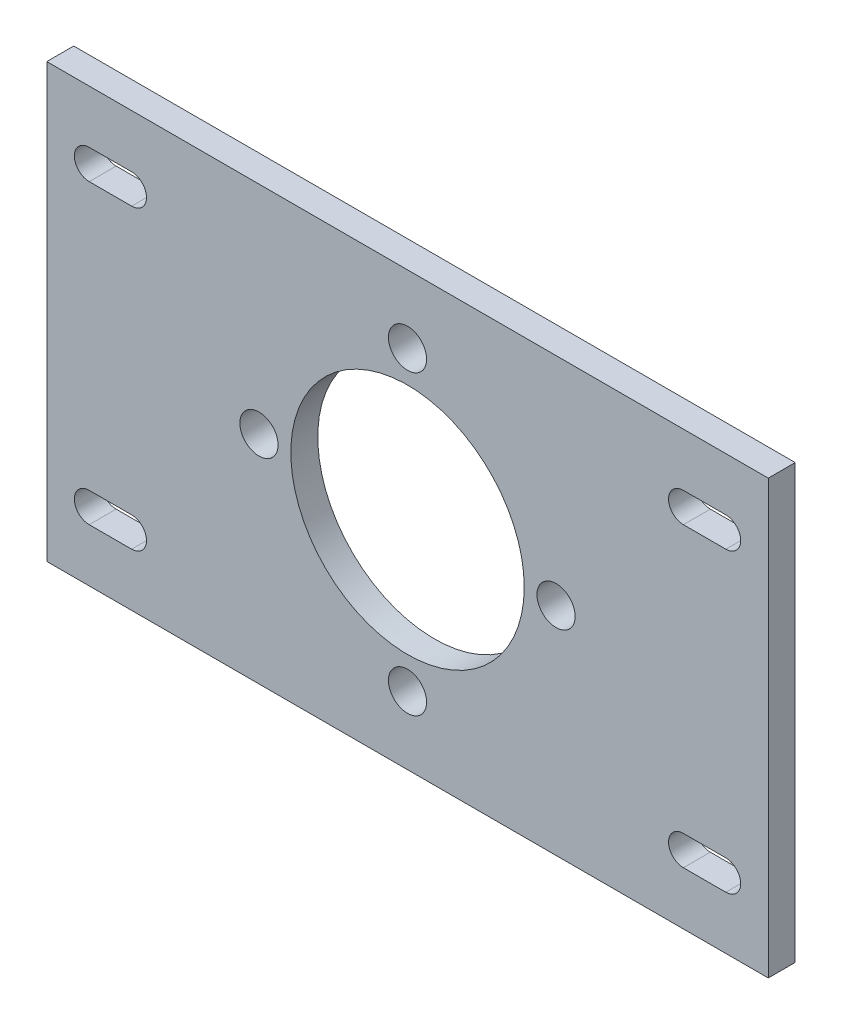
ISO-10303-21;
HEADER;
FILE_DESCRIPTION(('STEP AP214'),'2;1');
FILE_NAME('part.step','',(''),(''),'','','');
FILE_SCHEMA(('AUTOMOTIVE_DESIGN { 1 0 10303 214 1 1 1 1 }'));
ENDSEC;
DATA;
#1=APPLICATION_CONTEXT('core data for automotive mechanical design processes');
#2=APPLICATION_PROTOCOL_DEFINITION('international standard','automotive_design',2000,#1);
#3=PRODUCT_CONTEXT('',#1,'mechanical');
#4=PRODUCT('Part','Part','',(#3));
#5=PRODUCT_RELATED_PRODUCT_CATEGORY('part','',(#4));
#6=PRODUCT_DEFINITION_FORMATION('','',#4);
#7=PRODUCT_DEFINITION_CONTEXT('part definition',#1,'design');
#8=PRODUCT_DEFINITION('design','',#6,#7);
#9=PRODUCT_DEFINITION_SHAPE('','',#8);
#10=(LENGTH_UNIT() NAMED_UNIT(*) SI_UNIT(.MILLI.,.METRE.));
#11=(NAMED_UNIT(*) PLANE_ANGLE_UNIT() SI_UNIT($,.RADIAN.));
#12=(NAMED_UNIT(*) SI_UNIT($,.STERADIAN.) SOLID_ANGLE_UNIT());
#13=UNCERTAINTY_MEASURE_WITH_UNIT(LENGTH_MEASURE(1.E-05),#10,'distance_accuracy_value','');
#14=(GEOMETRIC_REPRESENTATION_CONTEXT(3) GLOBAL_UNCERTAINTY_ASSIGNED_CONTEXT((#13)) GLOBAL_UNIT_ASSIGNED_CONTEXT((#10,
#11,#12)) REPRESENTATION_CONTEXT('',''));
#15=CARTESIAN_POINT('',(0.,0.,0.));
#16=DIRECTION('',(0.,0.,1.));
#17=DIRECTION('',(1.,0.,0.));
#18=AXIS2_PLACEMENT_3D('',#15,#16,#17);
#19=CARTESIAN_POINT('',(0.,0.,3.175));
#20=DIRECTION('',(0.,0.,-1.));
#21=DIRECTION('',(-1.,0.,0.));
#22=AXIS2_PLACEMENT_3D('',#19,#20,#21);
#23=PLANE('',#22);
#24=CARTESIAN_POINT('',(37.5,-17.5,3.175));
#25=DIRECTION('',(0.,0.,1.));
#26=DIRECTION('',(1.,0.,0.));
#27=AXIS2_PLACEMENT_3D('',#24,#25,#26);
#28=CIRCLE('',#27,1.75000000000003);
#29=CARTESIAN_POINT('',(37.5,-19.2500000000001,3.175));
#30=VERTEX_POINT('',#29);
#31=CARTESIAN_POINT('',(37.5,-15.75,3.175));
#32=VERTEX_POINT('',#31);
#33=EDGE_CURVE('E454',#30,#32,#28,.T.);
#34=ORIENTED_EDGE('',*,*,#33,.F.);
#35=DIRECTION('',(1.,0.,0.));
#36=VECTOR('',#35,1.);
#37=CARTESIAN_POINT('',(37.5,-19.2500000000001,3.175));
#38=LINE('',#37,#36);
#39=CARTESIAN_POINT('',(32.5,-19.2500000000001,3.175));
#40=VERTEX_POINT('',#39);
#41=EDGE_CURVE('E444',#40,#30,#38,.T.);
#42=ORIENTED_EDGE('',*,*,#41,.F.);
#43=CARTESIAN_POINT('',(32.5,-17.5,3.175));
#44=DIRECTION('',(0.,0.,1.));
#45=DIRECTION('',(1.,0.,0.));
#46=AXIS2_PLACEMENT_3D('',#43,#44,#45);
#47=CIRCLE('',#46,1.75000000000003);
#48=CARTESIAN_POINT('',(32.5,-15.75,3.175));
#49=VERTEX_POINT('',#48);
#50=EDGE_CURVE('E447',#49,#40,#47,.T.);
#51=ORIENTED_EDGE('',*,*,#50,.F.);
#52=DIRECTION('',(-1.,0.,0.));
#53=VECTOR('',#52,1.);
#54=CARTESIAN_POINT('',(37.5,-15.75,3.175));
#55=LINE('',#54,#53);
#56=EDGE_CURVE('E451',#32,#49,#55,.T.);
#57=ORIENTED_EDGE('',*,*,#56,.F.);
#58=EDGE_LOOP('',(#34,#42,#51,#57));
#59=FACE_BOUND('',#58,.T.);
#60=CARTESIAN_POINT('',(-37.5,17.5,3.175));
#61=DIRECTION('',(0.,0.,1.));
#62=DIRECTION('',(1.,0.,0.));
#63=AXIS2_PLACEMENT_3D('',#60,#61,#62);
#64=CIRCLE('',#63,1.75000000000003);
#65=CARTESIAN_POINT('',(-37.5,19.2500000000001,3.175));
#66=VERTEX_POINT('',#65);
#67=CARTESIAN_POINT('',(-37.5,15.75,3.175));
#68=VERTEX_POINT('',#67);
#69=EDGE_CURVE('E386',#66,#68,#64,.T.);
#70=ORIENTED_EDGE('',*,*,#69,.F.);
#71=DIRECTION('',(-1.,0.,0.));
#72=VECTOR('',#71,1.);
#73=CARTESIAN_POINT('',(-37.5,19.2500000000001,3.175));
#74=LINE('',#73,#72);
#75=CARTESIAN_POINT('',(-32.5,19.2500000000001,3.175));
#76=VERTEX_POINT('',#75);
#77=EDGE_CURVE('E376',#76,#66,#74,.T.);
#78=ORIENTED_EDGE('',*,*,#77,.F.);
#79=CARTESIAN_POINT('',(-32.5,17.5,3.175));
#80=DIRECTION('',(0.,0.,1.));
#81=DIRECTION('',(1.,0.,0.));
#82=AXIS2_PLACEMENT_3D('',#79,#80,#81);
#83=CIRCLE('',#82,1.75000000000003);
#84=CARTESIAN_POINT('',(-32.5,15.75,3.175));
#85=VERTEX_POINT('',#84);
#86=EDGE_CURVE('E379',#85,#76,#83,.T.);
#87=ORIENTED_EDGE('',*,*,#86,.F.);
#88=DIRECTION('',(1.,0.,0.));
#89=VECTOR('',#88,1.);
#90=CARTESIAN_POINT('',(-37.5,15.75,3.175));
#91=LINE('',#90,#89);
#92=EDGE_CURVE('E383',#68,#85,#91,.T.);
#93=ORIENTED_EDGE('',*,*,#92,.F.);
#94=EDGE_LOOP('',(#70,#78,#87,#93));
#95=FACE_BOUND('',#94,.T.);
#96=DIRECTION('',(0.,-1.,0.));
#97=VECTOR('',#96,1.);
#98=CARTESIAN_POINT('',(-42.5,-25.5,3.175));
#99=LINE('',#98,#97);
#100=CARTESIAN_POINT('',(-42.5,25.5,3.175));
#101=VERTEX_POINT('',#100);
#102=CARTESIAN_POINT('',(-42.5,-25.5,3.175));
#103=VERTEX_POINT('',#102);
#104=EDGE_CURVE('E298',#101,#103,#99,.T.);
#105=ORIENTED_EDGE('',*,*,#104,.T.);
#106=DIRECTION('',(1.,0.,0.));
#107=VECTOR('',#106,1.);
#108=CARTESIAN_POINT('',(-42.5,-25.5,3.175));
#109=LINE('',#108,#107);
#110=CARTESIAN_POINT('',(42.5,-25.5,3.175));
#111=VERTEX_POINT('',#110);
#112=EDGE_CURVE('E303',#103,#111,#109,.T.);
#113=ORIENTED_EDGE('',*,*,#112,.T.);
#114=DIRECTION('',(0.,1.,0.));
#115=VECTOR('',#114,1.);
#116=CARTESIAN_POINT('',(42.5,-25.5,3.175));
#117=LINE('',#116,#115);
#118=CARTESIAN_POINT('',(42.5,25.5,3.175));
#119=VERTEX_POINT('',#118);
#120=EDGE_CURVE('E314',#111,#119,#117,.T.);
#121=ORIENTED_EDGE('',*,*,#120,.T.);
#122=DIRECTION('',(-1.,0.,0.));
#123=VECTOR('',#122,1.);
#124=CARTESIAN_POINT('',(-42.5,25.5,3.175));
#125=LINE('',#124,#123);
#126=EDGE_CURVE('E317',#119,#101,#125,.T.);
#127=ORIENTED_EDGE('',*,*,#126,.T.);
#128=EDGE_LOOP('',(#105,#113,#121,#127));
#129=FACE_BOUND('',#128,.T.);
#130=CARTESIAN_POINT('',(0.,0.,3.175));
#131=DIRECTION('',(0.,0.,1.));
#132=DIRECTION('',(1.,0.,0.));
#133=AXIS2_PLACEMENT_3D('',#130,#131,#132);
#134=CIRCLE('',#133,13.75);
#135=CARTESIAN_POINT('',(13.75,0.,3.175));
#136=VERTEX_POINT('',#135);
#137=EDGE_CURVE('E289',#136,#136,#134,.T.);
#138=ORIENTED_EDGE('',*,*,#137,.F.);
#139=EDGE_LOOP('',(#138));
#140=FACE_BOUND('',#139,.T.);
#141=CARTESIAN_POINT('',(0.,17.5,3.175));
#142=DIRECTION('',(0.,0.,1.));
#143=DIRECTION('',(1.,0.,0.));
#144=AXIS2_PLACEMENT_3D('',#141,#142,#143);
#145=CIRCLE('',#144,2.25);
#146=CARTESIAN_POINT('',(2.25,17.5,3.175));
#147=VERTEX_POINT('',#146);
#148=EDGE_CURVE('E281',#147,#147,#145,.T.);
#149=ORIENTED_EDGE('',*,*,#148,.F.);
#150=EDGE_LOOP('',(#149));
#151=FACE_BOUND('',#150,.T.);
#152=CARTESIAN_POINT('',(17.5,0.,3.175));
#153=DIRECTION('',(0.,0.,1.));
#154=DIRECTION('',(1.,0.,0.));
#155=AXIS2_PLACEMENT_3D('',#152,#153,#154);
#156=CIRCLE('',#155,2.25);
#157=CARTESIAN_POINT('',(19.75,0.,3.175));
#158=VERTEX_POINT('',#157);
#159=EDGE_CURVE('E270',#158,#158,#156,.T.);
#160=ORIENTED_EDGE('',*,*,#159,.F.);
#161=EDGE_LOOP('',(#160));
#162=FACE_BOUND('',#161,.T.);
#163=CARTESIAN_POINT('',(0.,-17.5,3.175));
#164=DIRECTION('',(0.,0.,1.));
#165=DIRECTION('',(1.,0.,0.));
#166=AXIS2_PLACEMENT_3D('',#163,#164,#165);
#167=CIRCLE('',#166,2.25);
#168=CARTESIAN_POINT('',(2.25,-17.5,3.175));
#169=VERTEX_POINT('',#168);
#170=EDGE_CURVE('E261',#169,#169,#167,.T.);
#171=ORIENTED_EDGE('',*,*,#170,.F.);
#172=EDGE_LOOP('',(#171));
#173=FACE_BOUND('',#172,.T.);
#174=CARTESIAN_POINT('',(-17.5,0.,3.175));
#175=DIRECTION('',(0.,0.,1.));
#176=DIRECTION('',(1.,0.,0.));
#177=AXIS2_PLACEMENT_3D('',#174,#175,#176);
#178=CIRCLE('',#177,2.25);
#179=CARTESIAN_POINT('',(-15.25,0.,3.175));
#180=VERTEX_POINT('',#179);
#181=EDGE_CURVE('E249',#180,#180,#178,.T.);
#182=ORIENTED_EDGE('',*,*,#181,.F.);
#183=EDGE_LOOP('',(#182));
#184=FACE_BOUND('',#183,.T.);
#185=CARTESIAN_POINT('',(37.5,17.5,3.175));
#186=DIRECTION('',(0.,0.,1.));
#187=DIRECTION('',(-1.,0.,0.));
#188=AXIS2_PLACEMENT_3D('',#185,#186,#187);
#189=CIRCLE('',#188,1.75000000000003);
#190=CARTESIAN_POINT('',(37.5,15.75,3.175));
#191=VERTEX_POINT('',#190);
#192=CARTESIAN_POINT('',(37.5,19.2500000000001,3.175));
#193=VERTEX_POINT('',#192);
#194=EDGE_CURVE('E229',#191,#193,#189,.T.);
#195=ORIENTED_EDGE('',*,*,#194,.F.);
#196=DIRECTION('',(1.,0.,0.));
#197=VECTOR('',#196,1.);
#198=CARTESIAN_POINT('',(37.5,15.75,3.175));
#199=LINE('',#198,#197);
#200=CARTESIAN_POINT('',(32.5,15.75,3.175));
#201=VERTEX_POINT('',#200);
#202=EDGE_CURVE('E236',#201,#191,#199,.T.);
#203=ORIENTED_EDGE('',*,*,#202,.F.);
#204=CARTESIAN_POINT('',(32.5,17.5,3.175));
#205=DIRECTION('',(0.,0.,1.));
#206=DIRECTION('',(-1.,0.,0.));
#207=AXIS2_PLACEMENT_3D('',#204,#205,#206);
#208=CIRCLE('',#207,1.75000000000003);
#209=CARTESIAN_POINT('',(32.5,19.2500000000001,3.175));
#210=VERTEX_POINT('',#209);
#211=EDGE_CURVE('E228',#210,#201,#208,.T.);
#212=ORIENTED_EDGE('',*,*,#211,.F.);
#213=DIRECTION('',(-1.,0.,0.));
#214=VECTOR('',#213,1.);
#215=CARTESIAN_POINT('',(37.5,19.2500000000001,3.175));
#216=LINE('',#215,#214);
#217=EDGE_CURVE('E224',#193,#210,#216,.T.);
#218=ORIENTED_EDGE('',*,*,#217,.F.);
#219=EDGE_LOOP('',(#195,#203,#212,#218));
#220=FACE_BOUND('',#219,.T.);
#221=CARTESIAN_POINT('',(-37.5,-17.5,3.175));
#222=DIRECTION('',(0.,0.,1.));
#223=DIRECTION('',(-1.,0.,0.));
#224=AXIS2_PLACEMENT_3D('',#221,#222,#223);
#225=CIRCLE('',#224,1.75000000000003);
#226=CARTESIAN_POINT('',(-37.5,-15.75,3.175));
#227=VERTEX_POINT('',#226);
#228=CARTESIAN_POINT('',(-37.5,-19.2500000000001,3.175));
#229=VERTEX_POINT('',#228);
#230=EDGE_CURVE('E184',#227,#229,#225,.T.);
#231=ORIENTED_EDGE('',*,*,#230,.F.);
#232=DIRECTION('',(-1.,0.,0.));
#233=VECTOR('',#232,1.);
#234=CARTESIAN_POINT('',(-37.5,-15.75,3.175));
#235=LINE('',#234,#233);
#236=CARTESIAN_POINT('',(-32.5,-15.75,3.175));
#237=VERTEX_POINT('',#236);
#238=EDGE_CURVE('E209',#237,#227,#235,.T.);
#239=ORIENTED_EDGE('',*,*,#238,.F.);
#240=CARTESIAN_POINT('',(-32.5,-17.5,3.175));
#241=DIRECTION('',(0.,0.,1.));
#242=DIRECTION('',(-1.,0.,0.));
#243=AXIS2_PLACEMENT_3D('',#240,#241,#242);
#244=CIRCLE('',#243,1.75000000000003);
#245=CARTESIAN_POINT('',(-32.5,-19.2500000000001,3.175));
#246=VERTEX_POINT('',#245);
#247=EDGE_CURVE('E206',#246,#237,#244,.T.);
#248=ORIENTED_EDGE('',*,*,#247,.F.);
#249=DIRECTION('',(1.,0.,0.));
#250=VECTOR('',#249,1.);
#251=CARTESIAN_POINT('',(-37.5,-19.2500000000001,3.175));
#252=LINE('',#251,#250);
#253=EDGE_CURVE('E193',#229,#246,#252,.T.);
#254=ORIENTED_EDGE('',*,*,#253,.F.);
#255=EDGE_LOOP('',(#231,#239,#248,#254));
#256=FACE_BOUND('',#255,.T.);
#257=ADVANCED_FACE('F46',(#59,#95,#129,#140,#151,#162,#173,#184,#220,#256),#23,.F.);
#258=CARTESIAN_POINT('',(0.,0.,0.));
#259=DIRECTION('',(0.,0.,-1.));
#260=DIRECTION('',(-1.,0.,0.));
#261=AXIS2_PLACEMENT_3D('',#258,#259,#260);
#262=PLANE('',#261);
#263=CARTESIAN_POINT('',(0.,-17.5,0.));
#264=DIRECTION('',(0.,0.,1.));
#265=DIRECTION('',(1.,0.,0.));
#266=AXIS2_PLACEMENT_3D('',#263,#264,#265);
#267=CIRCLE('',#266,2.25);
#268=CARTESIAN_POINT('',(2.25,-17.5,0.));
#269=VERTEX_POINT('',#268);
#270=EDGE_CURVE('E255',#269,#269,#267,.T.);
#271=ORIENTED_EDGE('',*,*,#270,.T.);
#272=EDGE_LOOP('',(#271));
#273=FACE_BOUND('',#272,.T.);
#274=CARTESIAN_POINT('',(0.,17.5,0.));
#275=DIRECTION('',(0.,0.,1.));
#276=DIRECTION('',(1.,0.,0.));
#277=AXIS2_PLACEMENT_3D('',#274,#275,#276);
#278=CIRCLE('',#277,2.25);
#279=CARTESIAN_POINT('',(2.25,17.5,0.));
#280=VERTEX_POINT('',#279);
#281=EDGE_CURVE('E275',#280,#280,#278,.T.);
#282=ORIENTED_EDGE('',*,*,#281,.T.);
#283=EDGE_LOOP('',(#282));
#284=FACE_BOUND('',#283,.T.);
#285=DIRECTION('',(0.,-1.,0.));
#286=VECTOR('',#285,1.);
#287=CARTESIAN_POINT('',(-42.5,-25.5,0.));
#288=LINE('',#287,#286);
#289=CARTESIAN_POINT('',(-42.5,25.5,0.));
#290=VERTEX_POINT('',#289);
#291=CARTESIAN_POINT('',(-42.5,-25.5,0.));
#292=VERTEX_POINT('',#291);
#293=EDGE_CURVE('E294',#290,#292,#288,.T.);
#294=ORIENTED_EDGE('',*,*,#293,.F.);
#295=DIRECTION('',(-1.,0.,0.));
#296=VECTOR('',#295,1.);
#297=CARTESIAN_POINT('',(-42.5,25.5,0.));
#298=LINE('',#297,#296);
#299=CARTESIAN_POINT('',(42.5,25.5,0.));
#300=VERTEX_POINT('',#299);
#301=EDGE_CURVE('E304',#300,#290,#298,.T.);
#302=ORIENTED_EDGE('',*,*,#301,.F.);
#303=DIRECTION('',(0.,1.,0.));
#304=VECTOR('',#303,1.);
#305=CARTESIAN_POINT('',(42.5,-25.5,0.));
#306=LINE('',#305,#304);
#307=CARTESIAN_POINT('',(42.5,-25.5,0.));
#308=VERTEX_POINT('',#307);
#309=EDGE_CURVE('E328',#308,#300,#306,.T.);
#310=ORIENTED_EDGE('',*,*,#309,.F.);
#311=DIRECTION('',(1.,0.,0.));
#312=VECTOR('',#311,1.);
#313=CARTESIAN_POINT('',(-42.5,-25.5,0.));
#314=LINE('',#313,#312);
#315=EDGE_CURVE('E325',#292,#308,#314,.T.);
#316=ORIENTED_EDGE('',*,*,#315,.F.);
#317=EDGE_LOOP('',(#294,#302,#310,#316));
#318=FACE_BOUND('',#317,.T.);
#319=CARTESIAN_POINT('',(0.,0.,0.));
#320=DIRECTION('',(0.,0.,1.));
#321=DIRECTION('',(1.,0.,0.));
#322=AXIS2_PLACEMENT_3D('',#319,#320,#321);
#323=CIRCLE('',#322,13.75);
#324=CARTESIAN_POINT('',(13.75,0.,0.));
#325=VERTEX_POINT('',#324);
#326=EDGE_CURVE('E286',#325,#325,#323,.T.);
#327=ORIENTED_EDGE('',*,*,#326,.T.);
#328=EDGE_LOOP('',(#327));
#329=FACE_BOUND('',#328,.T.);
#330=CARTESIAN_POINT('',(17.5,0.,0.));
#331=DIRECTION('',(0.,0.,1.));
#332=DIRECTION('',(1.,0.,0.));
#333=AXIS2_PLACEMENT_3D('',#330,#331,#332);
#334=CIRCLE('',#333,2.25);
#335=CARTESIAN_POINT('',(19.75,0.,0.));
#336=VERTEX_POINT('',#335);
#337=EDGE_CURVE('E266',#336,#336,#334,.T.);
#338=ORIENTED_EDGE('',*,*,#337,.T.);
#339=EDGE_LOOP('',(#338));
#340=FACE_BOUND('',#339,.T.);
#341=CARTESIAN_POINT('',(-17.5,0.,0.));
#342=DIRECTION('',(0.,0.,1.));
#343=DIRECTION('',(1.,0.,0.));
#344=AXIS2_PLACEMENT_3D('',#341,#342,#343);
#345=CIRCLE('',#344,2.25);
#346=CARTESIAN_POINT('',(-15.25,0.,0.));
#347=VERTEX_POINT('',#346);
#348=EDGE_CURVE('E256',#347,#347,#345,.T.);
#349=ORIENTED_EDGE('',*,*,#348,.T.);
#350=EDGE_LOOP('',(#349));
#351=FACE_BOUND('',#350,.T.);
#352=DIRECTION('',(-1.,0.,0.));
#353=VECTOR('',#352,1.);
#354=CARTESIAN_POINT('',(-37.5,19.2500000000001,0.));
#355=LINE('',#354,#353);
#356=CARTESIAN_POINT('',(-32.5,19.2500000000001,0.));
#357=VERTEX_POINT('',#356);
#358=CARTESIAN_POINT('',(-37.5,19.2500000000001,0.));
#359=VERTEX_POINT('',#358);
#360=EDGE_CURVE('E388',#357,#359,#355,.T.);
#361=ORIENTED_EDGE('',*,*,#360,.T.);
#362=CARTESIAN_POINT('',(-37.5,17.5,0.));
#363=DIRECTION('',(0.,0.,1.));
#364=DIRECTION('',(1.,0.,0.));
#365=AXIS2_PLACEMENT_3D('',#362,#363,#364);
#366=CIRCLE('',#365,1.75000000000003);
#367=CARTESIAN_POINT('',(-37.5,15.75,0.));
#368=VERTEX_POINT('',#367);
#369=EDGE_CURVE('E400',#359,#368,#366,.T.);
#370=ORIENTED_EDGE('',*,*,#369,.T.);
#371=DIRECTION('',(1.,0.,0.));
#372=VECTOR('',#371,1.);
#373=CARTESIAN_POINT('',(-37.5,15.75,0.));
#374=LINE('',#373,#372);
#375=CARTESIAN_POINT('',(-32.5,15.75,0.));
#376=VERTEX_POINT('',#375);
#377=EDGE_CURVE('E396',#368,#376,#374,.T.);
#378=ORIENTED_EDGE('',*,*,#377,.T.);
#379=CARTESIAN_POINT('',(-32.5,17.5,0.));
#380=DIRECTION('',(0.,0.,1.));
#381=DIRECTION('',(1.,0.,0.));
#382=AXIS2_PLACEMENT_3D('',#379,#380,#381);
#383=CIRCLE('',#382,1.75000000000003);
#384=EDGE_CURVE('E392',#376,#357,#383,.T.);
#385=ORIENTED_EDGE('',*,*,#384,.T.);
#386=EDGE_LOOP('',(#361,#370,#378,#385));
#387=FACE_BOUND('',#386,.T.);
#388=DIRECTION('',(1.,0.,0.));
#389=VECTOR('',#388,1.);
#390=CARTESIAN_POINT('',(37.5,15.75,0.));
#391=LINE('',#390,#389);
#392=CARTESIAN_POINT('',(32.5,15.75,0.));
#393=VERTEX_POINT('',#392);
#394=CARTESIAN_POINT('',(37.5,15.75,0.));
#395=VERTEX_POINT('',#394);
#396=EDGE_CURVE('E419',#393,#395,#391,.T.);
#397=ORIENTED_EDGE('',*,*,#396,.T.);
#398=CARTESIAN_POINT('',(37.5,17.5,0.));
#399=DIRECTION('',(0.,0.,1.));
#400=DIRECTION('',(-1.,0.,0.));
#401=AXIS2_PLACEMENT_3D('',#398,#399,#400);
#402=CIRCLE('',#401,1.75000000000003);
#403=CARTESIAN_POINT('',(37.5,19.2500000000001,0.));
#404=VERTEX_POINT('',#403);
#405=EDGE_CURVE('E241',#395,#404,#402,.T.);
#406=ORIENTED_EDGE('',*,*,#405,.T.);
#407=DIRECTION('',(-1.,0.,0.));
#408=VECTOR('',#407,1.);
#409=CARTESIAN_POINT('',(37.5,19.2500000000001,0.));
#410=LINE('',#409,#408);
#411=CARTESIAN_POINT('',(32.5,19.2500000000001,0.));
#412=VERTEX_POINT('',#411);
#413=EDGE_CURVE('E426',#404,#412,#410,.T.);
#414=ORIENTED_EDGE('',*,*,#413,.T.);
#415=CARTESIAN_POINT('',(32.5,17.5,0.));
#416=DIRECTION('',(0.,0.,1.));
#417=DIRECTION('',(-1.,0.,0.));
#418=AXIS2_PLACEMENT_3D('',#415,#416,#417);
#419=CIRCLE('',#418,1.75000000000003);
#420=EDGE_CURVE('E422',#412,#393,#419,.T.);
#421=ORIENTED_EDGE('',*,*,#420,.T.);
#422=EDGE_LOOP('',(#397,#406,#414,#421));
#423=FACE_BOUND('',#422,.T.);
#424=DIRECTION('',(1.,0.,0.));
#425=VECTOR('',#424,1.);
#426=CARTESIAN_POINT('',(37.5,-19.2500000000001,0.));
#427=LINE('',#426,#425);
#428=CARTESIAN_POINT('',(32.5,-19.2500000000001,0.));
#429=VERTEX_POINT('',#428);
#430=CARTESIAN_POINT('',(37.5,-19.2500000000001,0.));
#431=VERTEX_POINT('',#430);
#432=EDGE_CURVE('E457',#429,#431,#427,.T.);
#433=ORIENTED_EDGE('',*,*,#432,.T.);
#434=CARTESIAN_POINT('',(37.5,-17.5,0.));
#435=DIRECTION('',(0.,0.,1.));
#436=DIRECTION('',(1.,0.,0.));
#437=AXIS2_PLACEMENT_3D('',#434,#435,#436);
#438=CIRCLE('',#437,1.75000000000003);
#439=CARTESIAN_POINT('',(37.5,-15.75,0.));
#440=VERTEX_POINT('',#439);
#441=EDGE_CURVE('E202',#431,#440,#438,.T.);
#442=ORIENTED_EDGE('',*,*,#441,.T.);
#443=DIRECTION('',(-1.,0.,0.));
#444=VECTOR('',#443,1.);
#445=CARTESIAN_POINT('',(37.5,-15.75,0.));
#446=LINE('',#445,#444);
#447=CARTESIAN_POINT('',(32.5,-15.75,0.));
#448=VERTEX_POINT('',#447);
#449=EDGE_CURVE('E465',#440,#448,#446,.T.);
#450=ORIENTED_EDGE('',*,*,#449,.T.);
#451=CARTESIAN_POINT('',(32.5,-17.5,0.));
#452=DIRECTION('',(0.,0.,1.));
#453=DIRECTION('',(1.,0.,0.));
#454=AXIS2_PLACEMENT_3D('',#451,#452,#453);
#455=CIRCLE('',#454,1.75000000000003);
#456=EDGE_CURVE('E461',#448,#429,#455,.T.);
#457=ORIENTED_EDGE('',*,*,#456,.T.);
#458=EDGE_LOOP('',(#433,#442,#450,#457));
#459=FACE_BOUND('',#458,.T.);
#460=DIRECTION('',(-1.,0.,0.));
#461=VECTOR('',#460,1.);
#462=CARTESIAN_POINT('',(-37.5,-15.75,0.));
#463=LINE('',#462,#461);
#464=CARTESIAN_POINT('',(-32.5,-15.75,0.));
#465=VERTEX_POINT('',#464);
#466=CARTESIAN_POINT('',(-37.5,-15.75,0.));
#467=VERTEX_POINT('',#466);
#468=EDGE_CURVE('E194',#465,#467,#463,.T.);
#469=ORIENTED_EDGE('',*,*,#468,.T.);
#470=CARTESIAN_POINT('',(-37.5,-17.5,0.));
#471=DIRECTION('',(0.,0.,1.));
#472=DIRECTION('',(-1.,0.,0.));
#473=AXIS2_PLACEMENT_3D('',#470,#471,#472);
#474=CIRCLE('',#473,1.75000000000003);
#475=CARTESIAN_POINT('',(-37.5,-19.2500000000001,0.));
#476=VERTEX_POINT('',#475);
#477=EDGE_CURVE('E70',#467,#476,#474,.T.);
#478=ORIENTED_EDGE('',*,*,#477,.T.);
#479=DIRECTION('',(1.,0.,0.));
#480=VECTOR('',#479,1.);
#481=CARTESIAN_POINT('',(-37.5,-19.2500000000001,0.));
#482=LINE('',#481,#480);
#483=CARTESIAN_POINT('',(-32.5,-19.2500000000001,0.));
#484=VERTEX_POINT('',#483);
#485=EDGE_CURVE('E200',#476,#484,#482,.T.);
#486=ORIENTED_EDGE('',*,*,#485,.T.);
#487=CARTESIAN_POINT('',(-32.5,-17.5,0.));
#488=DIRECTION('',(0.,0.,1.));
#489=DIRECTION('',(-1.,0.,0.));
#490=AXIS2_PLACEMENT_3D('',#487,#488,#489);
#491=CIRCLE('',#490,1.75000000000003);
#492=EDGE_CURVE('E484',#484,#465,#491,.T.);
#493=ORIENTED_EDGE('',*,*,#492,.T.);
#494=EDGE_LOOP('',(#469,#478,#486,#493));
#495=FACE_BOUND('',#494,.T.);
#496=ADVANCED_FACE('F351',(#273,#284,#318,#329,#340,#351,#387,#423,#459,#495),#262,.T.);
#497=CARTESIAN_POINT('',(-42.5,-25.5,3.175));
#498=DIRECTION('',(1.,0.,0.));
#499=DIRECTION('',(0.,0.,-1.));
#500=AXIS2_PLACEMENT_3D('',#497,#498,#499);
#501=PLANE('',#500);
#502=ORIENTED_EDGE('',*,*,#293,.T.);
#503=DIRECTION('',(0.,0.,-1.));
#504=VECTOR('',#503,1.);
#505=CARTESIAN_POINT('',(-42.5,-25.5,3.175));
#506=LINE('',#505,#504);
#507=EDGE_CURVE('E12',#103,#292,#506,.T.);
#508=ORIENTED_EDGE('',*,*,#507,.F.);
#509=ORIENTED_EDGE('',*,*,#104,.F.);
#510=DIRECTION('',(0.,0.,-1.));
#511=VECTOR('',#510,1.);
#512=CARTESIAN_POINT('',(-42.5,25.5,3.175));
#513=LINE('',#512,#511);
#514=EDGE_CURVE('E321',#101,#290,#513,.T.);
#515=ORIENTED_EDGE('',*,*,#514,.T.);
#516=EDGE_LOOP('',(#502,#508,#509,#515));
#517=FACE_BOUND('',#516,.T.);
#518=ADVANCED_FACE('F48',(#517),#501,.F.);
#519=CARTESIAN_POINT('',(-42.5,-25.5,3.175));
#520=DIRECTION('',(0.,1.,0.));
#521=DIRECTION('',(0.,0.,1.));
#522=AXIS2_PLACEMENT_3D('',#519,#520,#521);
#523=PLANE('',#522);
#524=ORIENTED_EDGE('',*,*,#315,.T.);
#525=DIRECTION('',(0.,0.,-1.));
#526=VECTOR('',#525,1.);
#527=CARTESIAN_POINT('',(42.5,-25.5,3.175));
#528=LINE('',#527,#526);
#529=EDGE_CURVE('E55',#111,#308,#528,.T.);
#530=ORIENTED_EDGE('',*,*,#529,.F.);
#531=ORIENTED_EDGE('',*,*,#112,.F.);
#532=ORIENTED_EDGE('',*,*,#507,.T.);
#533=EDGE_LOOP('',(#524,#530,#531,#532));
#534=FACE_BOUND('',#533,.T.);
#535=ADVANCED_FACE('F533',(#534),#523,.F.);
#536=CARTESIAN_POINT('',(42.5,-25.5,3.175));
#537=DIRECTION('',(-1.,0.,0.));
#538=DIRECTION('',(0.,-1.,0.));
#539=AXIS2_PLACEMENT_3D('',#536,#537,#538);
#540=PLANE('',#539);
#541=ORIENTED_EDGE('',*,*,#309,.T.);
#542=DIRECTION('',(0.,0.,-1.));
#543=VECTOR('',#542,1.);
#544=CARTESIAN_POINT('',(42.5,25.5,3.175));
#545=LINE('',#544,#543);
#546=EDGE_CURVE('E336',#119,#300,#545,.T.);
#547=ORIENTED_EDGE('',*,*,#546,.F.);
#548=ORIENTED_EDGE('',*,*,#120,.F.);
#549=ORIENTED_EDGE('',*,*,#529,.T.);
#550=EDGE_LOOP('',(#541,#547,#548,#549));
#551=FACE_BOUND('',#550,.T.);
#552=ADVANCED_FACE('F345',(#551),#540,.F.);
#553=CARTESIAN_POINT('',(-42.5,25.5,3.175));
#554=DIRECTION('',(0.,-1.,0.));
#555=DIRECTION('',(0.,0.,-1.));
#556=AXIS2_PLACEMENT_3D('',#553,#554,#555);
#557=PLANE('',#556);
#558=ORIENTED_EDGE('',*,*,#301,.T.);
#559=ORIENTED_EDGE('',*,*,#514,.F.);
#560=ORIENTED_EDGE('',*,*,#126,.F.);
#561=ORIENTED_EDGE('',*,*,#546,.T.);
#562=EDGE_LOOP('',(#558,#559,#560,#561));
#563=FACE_BOUND('',#562,.T.);
#564=ADVANCED_FACE('F355',(#563),#557,.F.);
#565=CARTESIAN_POINT('',(0.,0.,3.175));
#566=DIRECTION('',(0.,0.,-1.));
#567=DIRECTION('',(-1.,0.,0.));
#568=AXIS2_PLACEMENT_3D('',#565,#566,#567);
#569=CYLINDRICAL_SURFACE('',#568,13.75);
#570=ORIENTED_EDGE('',*,*,#137,.T.);
#571=EDGE_LOOP('',(#570));
#572=FACE_BOUND('',#571,.T.);
#573=ORIENTED_EDGE('',*,*,#326,.F.);
#574=EDGE_LOOP('',(#573));
#575=FACE_BOUND('',#574,.T.);
#576=ADVANCED_FACE('F527',(#572,#575),#569,.F.);
#577=CARTESIAN_POINT('',(0.,17.5,3.175));
#578=DIRECTION('',(0.,0.,-1.));
#579=DIRECTION('',(-1.,0.,0.));
#580=AXIS2_PLACEMENT_3D('',#577,#578,#579);
#581=CYLINDRICAL_SURFACE('',#580,2.25);
#582=ORIENTED_EDGE('',*,*,#148,.T.);
#583=EDGE_LOOP('',(#582));
#584=FACE_BOUND('',#583,.T.);
#585=ORIENTED_EDGE('',*,*,#281,.F.);
#586=EDGE_LOOP('',(#585));
#587=FACE_BOUND('',#586,.T.);
#588=ADVANCED_FACE('F573',(#584,#587),#581,.F.);
#589=CARTESIAN_POINT('',(17.5,0.,3.175));
#590=DIRECTION('',(0.,0.,-1.));
#591=DIRECTION('',(-1.,0.,0.));
#592=AXIS2_PLACEMENT_3D('',#589,#590,#591);
#593=CYLINDRICAL_SURFACE('',#592,2.25);
#594=ORIENTED_EDGE('',*,*,#159,.T.);
#595=EDGE_LOOP('',(#594));
#596=FACE_BOUND('',#595,.T.);
#597=ORIENTED_EDGE('',*,*,#337,.F.);
#598=EDGE_LOOP('',(#597));
#599=FACE_BOUND('',#598,.T.);
#600=ADVANCED_FACE('F581',(#596,#599),#593,.F.);
#601=CARTESIAN_POINT('',(0.,-17.5,3.175));
#602=DIRECTION('',(0.,0.,-1.));
#603=DIRECTION('',(-1.,0.,0.));
#604=AXIS2_PLACEMENT_3D('',#601,#602,#603);
#605=CYLINDRICAL_SURFACE('',#604,2.25);
#606=ORIENTED_EDGE('',*,*,#170,.T.);
#607=EDGE_LOOP('',(#606));
#608=FACE_BOUND('',#607,.T.);
#609=ORIENTED_EDGE('',*,*,#270,.F.);
#610=EDGE_LOOP('',(#609));
#611=FACE_BOUND('',#610,.T.);
#612=ADVANCED_FACE('F589',(#608,#611),#605,.F.);
#613=CARTESIAN_POINT('',(-17.5,0.,3.175));
#614=DIRECTION('',(0.,0.,-1.));
#615=DIRECTION('',(-1.,0.,0.));
#616=AXIS2_PLACEMENT_3D('',#613,#614,#615);
#617=CYLINDRICAL_SURFACE('',#616,2.25);
#618=ORIENTED_EDGE('',*,*,#181,.T.);
#619=EDGE_LOOP('',(#618));
#620=FACE_BOUND('',#619,.T.);
#621=ORIENTED_EDGE('',*,*,#348,.F.);
#622=EDGE_LOOP('',(#621));
#623=FACE_BOUND('',#622,.T.);
#624=ADVANCED_FACE('F598',(#620,#623),#617,.F.);
#625=CARTESIAN_POINT('',(-37.5,17.5,3.175));
#626=DIRECTION('',(0.,0.,-1.));
#627=DIRECTION('',(-1.,0.,0.));
#628=AXIS2_PLACEMENT_3D('',#625,#626,#627);
#629=CYLINDRICAL_SURFACE('',#628,1.75000000000003);
#630=ORIENTED_EDGE('',*,*,#369,.F.);
#631=DIRECTION('',(0.,0.,-1.));
#632=VECTOR('',#631,1.);
#633=CARTESIAN_POINT('',(-37.5,19.2500000000001,3.175));
#634=LINE('',#633,#632);
#635=EDGE_CURVE('E372',#66,#359,#634,.T.);
#636=ORIENTED_EDGE('',*,*,#635,.F.);
#637=ORIENTED_EDGE('',*,*,#69,.T.);
#638=DIRECTION('',(0.,0.,-1.));
#639=VECTOR('',#638,1.);
#640=CARTESIAN_POINT('',(-37.5,15.75,3.175));
#641=LINE('',#640,#639);
#642=EDGE_CURVE('E257',#68,#368,#641,.T.);
#643=ORIENTED_EDGE('',*,*,#642,.T.);
#644=EDGE_LOOP('',(#630,#636,#637,#643));
#645=FACE_BOUND('',#644,.T.);
#646=ADVANCED_FACE('F607',(#645),#629,.F.);
#647=CARTESIAN_POINT('',(-37.5,15.75,3.175));
#648=DIRECTION('',(0.,1.,0.));
#649=DIRECTION('',(0.,0.,1.));
#650=AXIS2_PLACEMENT_3D('',#647,#648,#649);
#651=PLANE('',#650);
#652=ORIENTED_EDGE('',*,*,#377,.F.);
#653=ORIENTED_EDGE('',*,*,#642,.F.);
#654=ORIENTED_EDGE('',*,*,#92,.T.);
#655=DIRECTION('',(0.,0.,-1.));
#656=VECTOR('',#655,1.);
#657=CARTESIAN_POINT('',(-32.5,15.75,3.175));
#658=LINE('',#657,#656);
#659=EDGE_CURVE('E368',#85,#376,#658,.T.);
#660=ORIENTED_EDGE('',*,*,#659,.T.);
#661=EDGE_LOOP('',(#652,#653,#654,#660));
#662=FACE_BOUND('',#661,.T.);
#663=ADVANCED_FACE('F616',(#662),#651,.T.);
#664=CARTESIAN_POINT('',(-32.5,17.5,3.175));
#665=DIRECTION('',(0.,0.,-1.));
#666=DIRECTION('',(-1.,0.,0.));
#667=AXIS2_PLACEMENT_3D('',#664,#665,#666);
#668=CYLINDRICAL_SURFACE('',#667,1.75000000000003);
#669=ORIENTED_EDGE('',*,*,#384,.F.);
#670=ORIENTED_EDGE('',*,*,#659,.F.);
#671=ORIENTED_EDGE('',*,*,#86,.T.);
#672=DIRECTION('',(0.,0.,-1.));
#673=VECTOR('',#672,1.);
#674=CARTESIAN_POINT('',(-32.5,19.2500000000001,3.175));
#675=LINE('',#674,#673);
#676=EDGE_CURVE('E370',#76,#357,#675,.T.);
#677=ORIENTED_EDGE('',*,*,#676,.T.);
#678=EDGE_LOOP('',(#669,#670,#671,#677));
#679=FACE_BOUND('',#678,.T.);
#680=ADVANCED_FACE('F625',(#679),#668,.F.);
#681=CARTESIAN_POINT('',(-37.5,19.2500000000001,3.175));
#682=DIRECTION('',(0.,-1.,0.));
#683=DIRECTION('',(0.,0.,-1.));
#684=AXIS2_PLACEMENT_3D('',#681,#682,#683);
#685=PLANE('',#684);
#686=ORIENTED_EDGE('',*,*,#360,.F.);
#687=ORIENTED_EDGE('',*,*,#676,.F.);
#688=ORIENTED_EDGE('',*,*,#77,.T.);
#689=ORIENTED_EDGE('',*,*,#635,.T.);
#690=EDGE_LOOP('',(#686,#687,#688,#689));
#691=FACE_BOUND('',#690,.T.);
#692=ADVANCED_FACE('F634',(#691),#685,.T.);
#693=CARTESIAN_POINT('',(37.5,17.5,3.175));
#694=DIRECTION('',(0.,0.,-1.));
#695=DIRECTION('',(-1.,0.,0.));
#696=AXIS2_PLACEMENT_3D('',#693,#694,#695);
#697=CYLINDRICAL_SURFACE('',#696,1.75000000000003);
#698=ORIENTED_EDGE('',*,*,#405,.F.);
#699=DIRECTION('',(0.,0.,-1.));
#700=VECTOR('',#699,1.);
#701=CARTESIAN_POINT('',(37.5,15.75,3.175));
#702=LINE('',#701,#700);
#703=EDGE_CURVE('E240',#191,#395,#702,.T.);
#704=ORIENTED_EDGE('',*,*,#703,.F.);
#705=ORIENTED_EDGE('',*,*,#194,.T.);
#706=DIRECTION('',(0.,0.,-1.));
#707=VECTOR('',#706,1.);
#708=CARTESIAN_POINT('',(37.5,19.2500000000001,3.175));
#709=LINE('',#708,#707);
#710=EDGE_CURVE('E404',#193,#404,#709,.T.);
#711=ORIENTED_EDGE('',*,*,#710,.T.);
#712=EDGE_LOOP('',(#698,#704,#705,#711));
#713=FACE_BOUND('',#712,.T.);
#714=ADVANCED_FACE('F643',(#713),#697,.F.);
#715=CARTESIAN_POINT('',(37.5,19.2500000000001,3.175));
#716=DIRECTION('',(0.,-1.,0.));
#717=DIRECTION('',(0.,0.,-1.));
#718=AXIS2_PLACEMENT_3D('',#715,#716,#717);
#719=PLANE('',#718);
#720=ORIENTED_EDGE('',*,*,#413,.F.);
#721=ORIENTED_EDGE('',*,*,#710,.F.);
#722=ORIENTED_EDGE('',*,*,#217,.T.);
#723=DIRECTION('',(0.,0.,-1.));
#724=VECTOR('',#723,1.);
#725=CARTESIAN_POINT('',(32.5,19.2500000000001,3.175));
#726=LINE('',#725,#724);
#727=EDGE_CURVE('E408',#210,#412,#726,.T.);
#728=ORIENTED_EDGE('',*,*,#727,.T.);
#729=EDGE_LOOP('',(#720,#721,#722,#728));
#730=FACE_BOUND('',#729,.T.);
#731=ADVANCED_FACE('F652',(#730),#719,.T.);
#732=CARTESIAN_POINT('',(32.5,17.5,3.175));
#733=DIRECTION('',(0.,0.,-1.));
#734=DIRECTION('',(-1.,0.,0.));
#735=AXIS2_PLACEMENT_3D('',#732,#733,#734);
#736=CYLINDRICAL_SURFACE('',#735,1.75000000000003);
#737=ORIENTED_EDGE('',*,*,#420,.F.);
#738=ORIENTED_EDGE('',*,*,#727,.F.);
#739=ORIENTED_EDGE('',*,*,#211,.T.);
#740=DIRECTION('',(0.,0.,-1.));
#741=VECTOR('',#740,1.);
#742=CARTESIAN_POINT('',(32.5,15.75,3.175));
#743=LINE('',#742,#741);
#744=EDGE_CURVE('E411',#201,#393,#743,.T.);
#745=ORIENTED_EDGE('',*,*,#744,.T.);
#746=EDGE_LOOP('',(#737,#738,#739,#745));
#747=FACE_BOUND('',#746,.T.);
#748=ADVANCED_FACE('F661',(#747),#736,.F.);
#749=CARTESIAN_POINT('',(37.5,15.75,3.175));
#750=DIRECTION('',(0.,1.,0.));
#751=DIRECTION('',(0.,0.,1.));
#752=AXIS2_PLACEMENT_3D('',#749,#750,#751);
#753=PLANE('',#752);
#754=ORIENTED_EDGE('',*,*,#396,.F.);
#755=ORIENTED_EDGE('',*,*,#744,.F.);
#756=ORIENTED_EDGE('',*,*,#202,.T.);
#757=ORIENTED_EDGE('',*,*,#703,.T.);
#758=EDGE_LOOP('',(#754,#755,#756,#757));
#759=FACE_BOUND('',#758,.T.);
#760=ADVANCED_FACE('F670',(#759),#753,.T.);
#761=CARTESIAN_POINT('',(37.5,-17.5,3.175));
#762=DIRECTION('',(0.,0.,-1.));
#763=DIRECTION('',(-1.,0.,0.));
#764=AXIS2_PLACEMENT_3D('',#761,#762,#763);
#765=CYLINDRICAL_SURFACE('',#764,1.75000000000003);
#766=ORIENTED_EDGE('',*,*,#441,.F.);
#767=DIRECTION('',(0.,0.,-1.));
#768=VECTOR('',#767,1.);
#769=CARTESIAN_POINT('',(37.5,-19.2500000000001,3.175));
#770=LINE('',#769,#768);
#771=EDGE_CURVE('E440',#30,#431,#770,.T.);
#772=ORIENTED_EDGE('',*,*,#771,.F.);
#773=ORIENTED_EDGE('',*,*,#33,.T.);
#774=DIRECTION('',(0.,0.,-1.));
#775=VECTOR('',#774,1.);
#776=CARTESIAN_POINT('',(37.5,-15.75,3.175));
#777=LINE('',#776,#775);
#778=EDGE_CURVE('E432',#32,#440,#777,.T.);
#779=ORIENTED_EDGE('',*,*,#778,.T.);
#780=EDGE_LOOP('',(#766,#772,#773,#779));
#781=FACE_BOUND('',#780,.T.);
#782=ADVANCED_FACE('F679',(#781),#765,.F.);
#783=CARTESIAN_POINT('',(37.5,-15.75,3.175));
#784=DIRECTION('',(0.,-1.,0.));
#785=DIRECTION('',(0.,0.,-1.));
#786=AXIS2_PLACEMENT_3D('',#783,#784,#785);
#787=PLANE('',#786);
#788=ORIENTED_EDGE('',*,*,#449,.F.);
#789=ORIENTED_EDGE('',*,*,#778,.F.);
#790=ORIENTED_EDGE('',*,*,#56,.T.);
#791=DIRECTION('',(0.,0.,-1.));
#792=VECTOR('',#791,1.);
#793=CARTESIAN_POINT('',(32.5,-15.75,3.175));
#794=LINE('',#793,#792);
#795=EDGE_CURVE('E435',#49,#448,#794,.T.);
#796=ORIENTED_EDGE('',*,*,#795,.T.);
#797=EDGE_LOOP('',(#788,#789,#790,#796));
#798=FACE_BOUND('',#797,.T.);
#799=ADVANCED_FACE('F688',(#798),#787,.T.);
#800=CARTESIAN_POINT('',(32.5,-17.5,3.175));
#801=DIRECTION('',(0.,0.,-1.));
#802=DIRECTION('',(-1.,0.,0.));
#803=AXIS2_PLACEMENT_3D('',#800,#801,#802);
#804=CYLINDRICAL_SURFACE('',#803,1.75000000000003);
#805=ORIENTED_EDGE('',*,*,#456,.F.);
#806=ORIENTED_EDGE('',*,*,#795,.F.);
#807=ORIENTED_EDGE('',*,*,#50,.T.);
#808=DIRECTION('',(0.,0.,-1.));
#809=VECTOR('',#808,1.);
#810=CARTESIAN_POINT('',(32.5,-19.2500000000001,3.175));
#811=LINE('',#810,#809);
#812=EDGE_CURVE('E437',#40,#429,#811,.T.);
#813=ORIENTED_EDGE('',*,*,#812,.T.);
#814=EDGE_LOOP('',(#805,#806,#807,#813));
#815=FACE_BOUND('',#814,.T.);
#816=ADVANCED_FACE('F697',(#815),#804,.F.);
#817=CARTESIAN_POINT('',(37.5,-19.2500000000001,3.175));
#818=DIRECTION('',(0.,1.,0.));
#819=DIRECTION('',(0.,0.,1.));
#820=AXIS2_PLACEMENT_3D('',#817,#818,#819);
#821=PLANE('',#820);
#822=ORIENTED_EDGE('',*,*,#432,.F.);
#823=ORIENTED_EDGE('',*,*,#812,.F.);
#824=ORIENTED_EDGE('',*,*,#41,.T.);
#825=ORIENTED_EDGE('',*,*,#771,.T.);
#826=EDGE_LOOP('',(#822,#823,#824,#825));
#827=FACE_BOUND('',#826,.T.);
#828=ADVANCED_FACE('F706',(#827),#821,.T.);
#829=CARTESIAN_POINT('',(-37.5,-17.5,3.175));
#830=DIRECTION('',(0.,0.,-1.));
#831=DIRECTION('',(-1.,0.,0.));
#832=AXIS2_PLACEMENT_3D('',#829,#830,#831);
#833=CYLINDRICAL_SURFACE('',#832,1.75000000000003);
#834=ORIENTED_EDGE('',*,*,#477,.F.);
#835=DIRECTION('',(0.,0.,-1.));
#836=VECTOR('',#835,1.);
#837=CARTESIAN_POINT('',(-37.5,-15.75,3.175));
#838=LINE('',#837,#836);
#839=EDGE_CURVE('E188',#227,#467,#838,.T.);
#840=ORIENTED_EDGE('',*,*,#839,.F.);
#841=ORIENTED_EDGE('',*,*,#230,.T.);
#842=DIRECTION('',(0.,0.,-1.));
#843=VECTOR('',#842,1.);
#844=CARTESIAN_POINT('',(-37.5,-19.2500000000001,3.175));
#845=LINE('',#844,#843);
#846=EDGE_CURVE('E187',#229,#476,#845,.T.);
#847=ORIENTED_EDGE('',*,*,#846,.T.);
#848=EDGE_LOOP('',(#834,#840,#841,#847));
#849=FACE_BOUND('',#848,.T.);
#850=ADVANCED_FACE('F186',(#849),#833,.F.);
#851=CARTESIAN_POINT('',(-37.5,-19.2500000000001,3.175));
#852=DIRECTION('',(0.,1.,0.));
#853=DIRECTION('',(0.,0.,1.));
#854=AXIS2_PLACEMENT_3D('',#851,#852,#853);
#855=PLANE('',#854);
#856=ORIENTED_EDGE('',*,*,#485,.F.);
#857=ORIENTED_EDGE('',*,*,#846,.F.);
#858=ORIENTED_EDGE('',*,*,#253,.T.);
#859=DIRECTION('',(0.,0.,-1.));
#860=VECTOR('',#859,1.);
#861=CARTESIAN_POINT('',(-32.5,-19.2500000000001,3.175));
#862=LINE('',#861,#860);
#863=EDGE_CURVE('E203',#246,#484,#862,.T.);
#864=ORIENTED_EDGE('',*,*,#863,.T.);
#865=EDGE_LOOP('',(#856,#857,#858,#864));
#866=FACE_BOUND('',#865,.T.);
#867=ADVANCED_FACE('F197',(#866),#855,.T.);
#868=CARTESIAN_POINT('',(-32.5,-17.5,3.175));
#869=DIRECTION('',(0.,0.,-1.));
#870=DIRECTION('',(-1.,0.,0.));
#871=AXIS2_PLACEMENT_3D('',#868,#869,#870);
#872=CYLINDRICAL_SURFACE('',#871,1.75000000000003);
#873=ORIENTED_EDGE('',*,*,#492,.F.);
#874=ORIENTED_EDGE('',*,*,#863,.F.);
#875=ORIENTED_EDGE('',*,*,#247,.T.);
#876=DIRECTION('',(0.,0.,-1.));
#877=VECTOR('',#876,1.);
#878=CARTESIAN_POINT('',(-32.5,-15.75,3.175));
#879=LINE('',#878,#877);
#880=EDGE_CURVE('E62',#237,#465,#879,.T.);
#881=ORIENTED_EDGE('',*,*,#880,.T.);
#882=EDGE_LOOP('',(#873,#874,#875,#881));
#883=FACE_BOUND('',#882,.T.);
#884=ADVANCED_FACE('F507',(#883),#872,.F.);
#885=CARTESIAN_POINT('',(-37.5,-15.75,3.175));
#886=DIRECTION('',(0.,-1.,0.));
#887=DIRECTION('',(0.,0.,-1.));
#888=AXIS2_PLACEMENT_3D('',#885,#886,#887);
#889=PLANE('',#888);
#890=ORIENTED_EDGE('',*,*,#468,.F.);
#891=ORIENTED_EDGE('',*,*,#880,.F.);
#892=ORIENTED_EDGE('',*,*,#238,.T.);
#893=ORIENTED_EDGE('',*,*,#839,.T.);
#894=EDGE_LOOP('',(#890,#891,#892,#893));
#895=FACE_BOUND('',#894,.T.);
#896=ADVANCED_FACE('F479',(#895),#889,.T.);
#897=CLOSED_SHELL('',(#257,#496,#518,#535,#552,#564,#576,#588,#600,#612,#624,#646,#663,#680,
#692,#714,#731,#748,#760,#782,#799,#816,#828,#850,#867,#884,#896));
#898=MANIFOLD_SOLID_BREP('B2',#897);
#899=ADVANCED_BREP_SHAPE_REPRESENTATION('',(#18,#898),#14);
#900=SHAPE_DEFINITION_REPRESENTATION(#9,#899);
ENDSEC;
END-ISO-10303-21;
